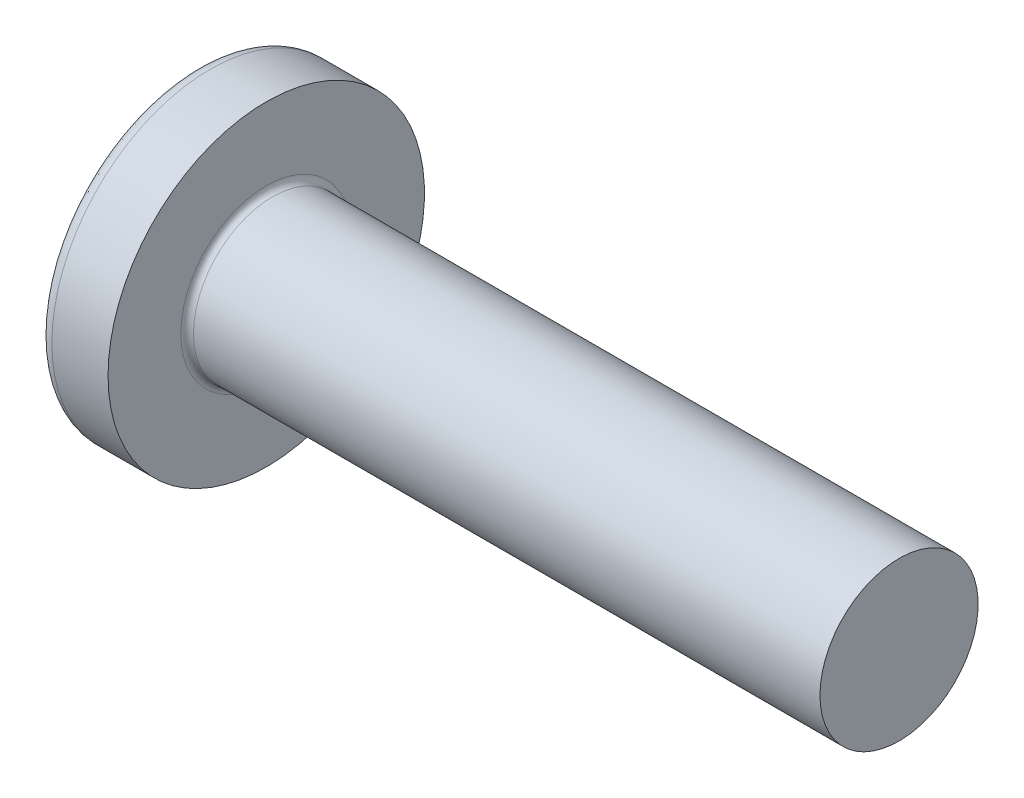
ISO-10303-21;
HEADER;
FILE_DESCRIPTION(('STEP AP214'),'2;1');
FILE_NAME('part.step','',(''),(''),'','','');
FILE_SCHEMA(('AUTOMOTIVE_DESIGN { 1 0 10303 214 1 1 1 1 }'));
ENDSEC;
DATA;
#1=APPLICATION_CONTEXT('core data for automotive mechanical design processes');
#2=APPLICATION_PROTOCOL_DEFINITION('international standard','automotive_design',2000,#1);
#3=PRODUCT_CONTEXT('',#1,'mechanical');
#4=PRODUCT('Part','Part','',(#3));
#5=PRODUCT_RELATED_PRODUCT_CATEGORY('part','',(#4));
#6=PRODUCT_DEFINITION_FORMATION('','',#4);
#7=PRODUCT_DEFINITION_CONTEXT('part definition',#1,'design');
#8=PRODUCT_DEFINITION('design','',#6,#7);
#9=PRODUCT_DEFINITION_SHAPE('','',#8);
#10=(LENGTH_UNIT() NAMED_UNIT(*) SI_UNIT(.MILLI.,.METRE.));
#11=(NAMED_UNIT(*) PLANE_ANGLE_UNIT() SI_UNIT($,.RADIAN.));
#12=(NAMED_UNIT(*) SI_UNIT($,.STERADIAN.) SOLID_ANGLE_UNIT());
#13=UNCERTAINTY_MEASURE_WITH_UNIT(LENGTH_MEASURE(1.E-05),#10,'distance_accuracy_value','');
#14=(GEOMETRIC_REPRESENTATION_CONTEXT(3) GLOBAL_UNCERTAINTY_ASSIGNED_CONTEXT((#13)) GLOBAL_UNIT_ASSIGNED_CONTEXT((#10,
#11,#12)) REPRESENTATION_CONTEXT('',''));
#15=CARTESIAN_POINT('',(0.,0.,0.));
#16=DIRECTION('',(0.,0.,1.));
#17=DIRECTION('',(1.,0.,0.));
#18=AXIS2_PLACEMENT_3D('',#15,#16,#17);
#19=CARTESIAN_POINT('',(16.,0.,0.));
#20=DIRECTION('',(-1.,0.,0.));
#21=DIRECTION('',(0.,1.,0.));
#22=AXIS2_PLACEMENT_3D('',#19,#20,#21);
#23=SPHERICAL_SURFACE('',#22,16.);
#24=CARTESIAN_POINT('',(3.23189799723057,0.,0.));
#25=DIRECTION('',(-1.,0.,0.));
#26=DIRECTION('',(0.,0.,1.));
#27=AXIS2_PLACEMENT_3D('',#24,#25,#26);
#28=CIRCLE('',#27,9.64238410596027);
#29=CARTESIAN_POINT('',(3.23189799723057,0.,9.64238410596027));
#30=VERTEX_POINT('',#29);
#31=EDGE_CURVE('E212',#30,#30,#28,.T.);
#32=ORIENTED_EDGE('',*,*,#31,.T.);
#33=EDGE_LOOP('',(#32));
#34=FACE_BOUND('',#33,.T.);
#35=CARTESIAN_POINT('',(0.168594787067849,0.,0.));
#36=DIRECTION('',(1.,0.,0.));
#37=DIRECTION('',(0.,0.,-1.));
#38=AXIS2_PLACEMENT_3D('',#35,#36,#37);
#39=CIRCLE('',#38,2.31659426398858);
#40=CARTESIAN_POINT('',(0.168594787067853,-1.07999999999999,-2.04944113941943));
#41=VERTEX_POINT('',#40);
#42=CARTESIAN_POINT('',(0.168594787067848,-2.04944113941942,-1.08));
#43=VERTEX_POINT('',#42);
#44=EDGE_CURVE('E338',#41,#43,#39,.F.);
#45=ORIENTED_EDGE('',*,*,#44,.F.);
#46=CARTESIAN_POINT('',(16.,-1.08,0.));
#47=DIRECTION('',(0.,1.,0.));
#48=DIRECTION('',(0.,0.,1.));
#49=AXIS2_PLACEMENT_3D('',#46,#47,#48);
#50=CIRCLE('',#49,15.9635083863166);
#51=CARTESIAN_POINT('',(0.712098414668225,-1.07999999999998,-4.59496083957308));
#52=VERTEX_POINT('',#51);
#53=EDGE_CURVE('E272',#52,#41,#50,.T.);
#54=ORIENTED_EDGE('',*,*,#53,.F.);
#55=CARTESIAN_POINT('',(14.7911432076015,0.,2.42459171093353));
#56=DIRECTION('',(0.446197800778958,0.,-0.89493436774996));
#57=DIRECTION('',(-0.89493436774996,0.,-0.446197800778958));
#58=AXIS2_PLACEMENT_3D('',#55,#56,#57);
#59=CIRCLE('',#58,15.7689574890271);
#60=CARTESIAN_POINT('',(0.712098414668225,1.08000000000002,-4.59496083957307));
#61=VERTEX_POINT('',#60);
#62=EDGE_CURVE('E246',#52,#61,#59,.T.);
#63=ORIENTED_EDGE('',*,*,#62,.T.);
#64=CARTESIAN_POINT('',(16.,1.08,0.));
#65=DIRECTION('',(0.,-1.,0.));
#66=DIRECTION('',(0.,0.,-1.));
#67=AXIS2_PLACEMENT_3D('',#64,#65,#66);
#68=CIRCLE('',#67,15.9635083863166);
#69=CARTESIAN_POINT('',(0.168594787067854,1.08000000000001,-2.04944113941942));
#70=VERTEX_POINT('',#69);
#71=EDGE_CURVE('E300',#70,#61,#68,.T.);
#72=ORIENTED_EDGE('',*,*,#71,.F.);
#73=CARTESIAN_POINT('',(0.168594787067848,2.04944113941941,-1.08));
#74=VERTEX_POINT('',#73);
#75=EDGE_CURVE('E353',#74,#70,#39,.F.);
#76=ORIENTED_EDGE('',*,*,#75,.F.);
#77=CARTESIAN_POINT('',(16.,0.,-1.08));
#78=DIRECTION('',(0.,0.,1.));
#79=DIRECTION('',(1.,0.,0.));
#80=AXIS2_PLACEMENT_3D('',#77,#78,#79);
#81=CIRCLE('',#80,15.9635083863166);
#82=CARTESIAN_POINT('',(0.712098414668223,4.59496083957308,-1.08));
#83=VERTEX_POINT('',#82);
#84=EDGE_CURVE('E240',#83,#74,#81,.T.);
#85=ORIENTED_EDGE('',*,*,#84,.F.);
#86=CARTESIAN_POINT('',(14.7911432076015,-2.42459171093353,0.));
#87=DIRECTION('',(0.446197800778958,0.89493436774996,0.));
#88=DIRECTION('',(-0.89493436774996,0.446197800778958,0.));
#89=AXIS2_PLACEMENT_3D('',#86,#87,#88);
#90=CIRCLE('',#89,15.7689574890271);
#91=CARTESIAN_POINT('',(0.712098414668223,4.59496083957308,1.08));
#92=VERTEX_POINT('',#91);
#93=EDGE_CURVE('E243',#83,#92,#90,.T.);
#94=ORIENTED_EDGE('',*,*,#93,.T.);
#95=CARTESIAN_POINT('',(16.,0.,1.08));
#96=DIRECTION('',(0.,0.,-1.));
#97=DIRECTION('',(0.,1.,0.));
#98=AXIS2_PLACEMENT_3D('',#95,#96,#97);
#99=CIRCLE('',#98,15.9635083863166);
#100=CARTESIAN_POINT('',(0.168594787067849,2.0494411394194,1.08));
#101=VERTEX_POINT('',#100);
#102=EDGE_CURVE('E236',#101,#92,#99,.T.);
#103=ORIENTED_EDGE('',*,*,#102,.F.);
#104=CARTESIAN_POINT('',(0.168594787067853,1.07999999999999,2.04944113941943));
#105=VERTEX_POINT('',#104);
#106=EDGE_CURVE('E352',#105,#101,#39,.F.);
#107=ORIENTED_EDGE('',*,*,#106,.F.);
#108=CARTESIAN_POINT('',(0.712098414668223,1.07999999999998,4.59496083957308));
#109=VERTEX_POINT('',#108);
#110=EDGE_CURVE('E256',#109,#105,#68,.T.);
#111=ORIENTED_EDGE('',*,*,#110,.F.);
#112=CARTESIAN_POINT('',(14.7911432076015,0.,-2.42459171093353));
#113=DIRECTION('',(0.446197800778958,0.,0.89493436774996));
#114=DIRECTION('',(0.89493436774996,0.,-0.446197800778958));
#115=AXIS2_PLACEMENT_3D('',#112,#113,#114);
#116=CIRCLE('',#115,15.7689574890271);
#117=CARTESIAN_POINT('',(0.712098414668221,-1.08000000000001,4.59496083957308));
#118=VERTEX_POINT('',#117);
#119=EDGE_CURVE('E47',#109,#118,#116,.T.);
#120=ORIENTED_EDGE('',*,*,#119,.T.);
#121=CARTESIAN_POINT('',(0.168594787067854,-1.08000000000001,2.04944113941942));
#122=VERTEX_POINT('',#121);
#123=EDGE_CURVE('E253',#122,#118,#50,.T.);
#124=ORIENTED_EDGE('',*,*,#123,.F.);
#125=CARTESIAN_POINT('',(0.168594787067849,-2.04944113941941,1.08));
#126=VERTEX_POINT('',#125);
#127=EDGE_CURVE('E384',#126,#122,#39,.F.);
#128=ORIENTED_EDGE('',*,*,#127,.F.);
#129=CARTESIAN_POINT('',(0.712098414668223,-4.59496083957308,1.08));
#130=VERTEX_POINT('',#129);
#131=EDGE_CURVE('E237',#130,#126,#99,.T.);
#132=ORIENTED_EDGE('',*,*,#131,.F.);
#133=CARTESIAN_POINT('',(14.7911432076015,2.42459171093353,0.));
#134=DIRECTION('',(0.446197800778958,-0.89493436774996,0.));
#135=DIRECTION('',(0.89493436774996,0.446197800778958,0.));
#136=AXIS2_PLACEMENT_3D('',#133,#134,#135);
#137=CIRCLE('',#136,15.7689574890271);
#138=CARTESIAN_POINT('',(0.712098414668223,-4.59496083957308,-1.08));
#139=VERTEX_POINT('',#138);
#140=EDGE_CURVE('E233',#130,#139,#137,.T.);
#141=ORIENTED_EDGE('',*,*,#140,.T.);
#142=EDGE_CURVE('E62',#43,#139,#81,.T.);
#143=ORIENTED_EDGE('',*,*,#142,.F.);
#144=EDGE_LOOP('',(#45,#54,#63,#72,#76,#85,#94,#103,#107,#111,#120,#124,#128,#132,#141,#143));
#145=FACE_BOUND('',#144,.T.);
#146=ADVANCED_FACE('F34',(#34,#145),#23,.T.);
#147=CARTESIAN_POINT('',(0.,4.94999999999999,-1.08));
#148=DIRECTION('',(0.,0.,1.));
#149=DIRECTION('',(1.,0.,0.));
#150=AXIS2_PLACEMENT_3D('',#147,#148,#149);
#151=PLANE('',#150);
#152=ORIENTED_EDGE('',*,*,#84,.T.);
#153=CARTESIAN_POINT('',(-3.43605311056389,2.33057774319368,-1.08));
#154=CARTESIAN_POINT('',(-2.73005788936149,2.27615518507628,-1.08));
#155=CARTESIAN_POINT('',(-2.02408650858328,2.22141913982355,-1.08));
#156=CARTESIAN_POINT('',(-0.612196178896327,2.11110719124856,-1.08));
#157=CARTESIAN_POINT('',(0.0937227687909002,2.05553127230214,-1.08));
#158=CARTESIAN_POINT('',(1.15253879223642,1.97137932907642,-1.08));
#159=CARTESIAN_POINT('',(1.50546717443926,1.94319732850324,-1.08));
#160=CARTESIAN_POINT('',(2.21129884226403,1.88653195912772,-1.08));
#161=CARTESIAN_POINT('',(2.56420212794819,1.85804859110097,-1.08));
#162=CARTESIAN_POINT('',(3.26997437360885,1.80073759682966,-1.08));
#163=CARTESIAN_POINT('',(3.62284333408858,1.77190997678611,-1.08));
#164=CARTESIAN_POINT('',(4.32855163516413,1.71385567830055,-1.08));
#165=CARTESIAN_POINT('',(4.68139097546501,1.68462899627166,-1.08));
#166=CARTESIAN_POINT('',(5.48196138691584,1.61778484426536,-1.08));
#167=CARTESIAN_POINT('',(5.92968063936628,1.5800255789917,-1.08));
#168=CARTESIAN_POINT('',(6.82503914618352,1.50358396776163,-1.08));
#169=CARTESIAN_POINT('',(7.27267840078263,1.46490162453115,-1.08));
#170=CARTESIAN_POINT('',(8.16783657307055,1.38637288862663,-1.08));
#171=CARTESIAN_POINT('',(8.61535549493061,1.34652654360286,-1.08));
#172=CARTESIAN_POINT('',(9.51026248486919,1.26532289179753,-1.08));
#173=CARTESIAN_POINT('',(9.95765055123335,1.22396556604181,-1.08));
#174=CARTESIAN_POINT('',(10.8523158736642,1.13920912306466,-1.08));
#175=CARTESIAN_POINT('',(11.2995930947875,1.09580963592832,-1.08));
#176=CARTESIAN_POINT('',(12.1938496891445,1.00615798148881,-1.08));
#177=CARTESIAN_POINT('',(12.6408290721386,0.959905912835485,-1.08));
#178=CARTESIAN_POINT('',(13.3109832262361,0.887238538031377,-1.08));
#179=CARTESIAN_POINT('',(13.5343356366705,0.862465479305157,-1.08));
#180=CARTESIAN_POINT('',(13.9808744583761,0.811493247434636,-1.08));
#181=CARTESIAN_POINT('',(14.204060872408,0.785294098569613,-1.08));
#182=CARTESIAN_POINT('',(14.6502320441495,0.73099572543514,-1.08));
#183=CARTESIAN_POINT('',(14.8732167746121,0.702896274763054,-1.08));
#184=CARTESIAN_POINT('',(15.2074339176581,0.658726299947166,-1.08));
#185=CARTESIAN_POINT('',(15.3187994773757,0.643665717094798,-1.08));
#186=CARTESIAN_POINT('',(15.5414149899271,0.612700054932443,-1.08));
#187=CARTESIAN_POINT('',(15.6526649406011,0.596794960123566,-1.08));
#188=CARTESIAN_POINT('',(15.7638416271016,0.580382331183072,-1.08));
#189=B_SPLINE_CURVE_WITH_KNOTS('',3,(#153,#154,#155,#156,#157,#158,#159,#160,#161,#162,#163,
#164,#165,#166,#167,#168,#169,#170,#171,#172,#173,#174,#175,#176,#177,#178,#179,#180,#181,#182,
#183,#184,#185,#186,#187,#188),.UNSPECIFIED.,.F.,.F.,(4,2,2,2,2,2,2,2,2,2,2,2,2,2,2,2,2,4),(0.,
2.12426964290659,4.24857885235091,5.3107341035929,6.37288662197896,7.43502003656715,
8.49716300414631,9.84508827634153,11.1930095684778,12.5408757584157,13.8887588800163,
15.2368871027213,16.5849687296847,17.2591314568035,17.9332827098455,18.6075144234906,
18.9446495011757,19.2817907682658),.UNSPECIFIED.);
#190=CARTESIAN_POINT('',(5.69,1.60013444747621,-1.08));
#191=VERTEX_POINT('',#190);
#192=EDGE_CURVE('E373',#74,#191,#189,.T.);
#193=ORIENTED_EDGE('',*,*,#192,.T.);
#194=DIRECTION('',(0.,1.,0.));
#195=VECTOR('',#194,1.);
#196=CARTESIAN_POINT('',(5.69,-2.11307074806449,-1.08));
#197=LINE('',#196,#195);
#198=CARTESIAN_POINT('',(5.69,2.11307074806449,-1.08));
#199=VERTEX_POINT('',#198);
#200=EDGE_CURVE('E321',#191,#199,#197,.T.);
#201=ORIENTED_EDGE('',*,*,#200,.T.);
#202=DIRECTION('',(0.89493436774996,-0.446197800778958,0.));
#203=VECTOR('',#202,1.);
#204=CARTESIAN_POINT('',(0.,4.95,-1.08));
#205=LINE('',#204,#203);
#206=EDGE_CURVE('E213',#83,#199,#205,.T.);
#207=ORIENTED_EDGE('',*,*,#206,.F.);
#208=EDGE_LOOP('',(#152,#193,#201,#207));
#209=FACE_BOUND('',#208,.T.);
#210=ADVANCED_FACE('F168',(#209),#151,.T.);
#211=CARTESIAN_POINT('',(5.69,-2.11307074806449,-1.08));
#212=VERTEX_POINT('',#211);
#213=CARTESIAN_POINT('',(5.69,-1.60013444747621,-1.08));
#214=VERTEX_POINT('',#213);
#215=EDGE_CURVE('E221',#212,#214,#197,.T.);
#216=ORIENTED_EDGE('',*,*,#215,.T.);
#217=CARTESIAN_POINT('',(-3.43605311056389,-2.33057774319368,-1.08));
#218=CARTESIAN_POINT('',(-2.73005788936149,-2.27615518507629,-1.08));
#219=CARTESIAN_POINT('',(-2.02408650858328,-2.22141913982355,-1.08));
#220=CARTESIAN_POINT('',(-0.612196178896328,-2.11110719124856,-1.08));
#221=CARTESIAN_POINT('',(0.0937227687908998,-2.05553127230214,-1.08));
#222=CARTESIAN_POINT('',(1.15253879223642,-1.97137932907642,-1.08));
#223=CARTESIAN_POINT('',(1.50546717443926,-1.94319732850324,-1.08));
#224=CARTESIAN_POINT('',(2.21129884226403,-1.88653195912772,-1.08));
#225=CARTESIAN_POINT('',(2.56420212794819,-1.85804859110097,-1.08));
#226=CARTESIAN_POINT('',(3.26997437360886,-1.80073759682966,-1.08));
#227=CARTESIAN_POINT('',(3.62284333408858,-1.77190997678611,-1.08));
#228=CARTESIAN_POINT('',(4.32855163516413,-1.71385567830055,-1.08));
#229=CARTESIAN_POINT('',(4.68139097546501,-1.68462899627166,-1.08));
#230=CARTESIAN_POINT('',(5.48196138691584,-1.61778484426536,-1.08));
#231=CARTESIAN_POINT('',(5.92968063936628,-1.5800255789917,-1.08));
#232=CARTESIAN_POINT('',(6.82503914618352,-1.50358396776163,-1.08));
#233=CARTESIAN_POINT('',(7.27267840078263,-1.46490162453115,-1.08));
#234=CARTESIAN_POINT('',(8.16783657307055,-1.38637288862663,-1.08));
#235=CARTESIAN_POINT('',(8.61535549493061,-1.34652654360286,-1.08));
#236=CARTESIAN_POINT('',(9.51026248486919,-1.26532289179753,-1.08));
#237=CARTESIAN_POINT('',(9.95765055123334,-1.22396556604181,-1.08));
#238=CARTESIAN_POINT('',(10.8523158736642,-1.13920912306466,-1.08));
#239=CARTESIAN_POINT('',(11.2995930947875,-1.09580963592832,-1.08));
#240=CARTESIAN_POINT('',(12.1938496891445,-1.00615798148881,-1.08));
#241=CARTESIAN_POINT('',(12.6408290721386,-0.959905912835485,-1.08));
#242=CARTESIAN_POINT('',(13.3109832262361,-0.887238538031376,-1.08));
#243=CARTESIAN_POINT('',(13.5343356366705,-0.862465479305157,-1.08));
#244=CARTESIAN_POINT('',(13.9808744583761,-0.811493247434636,-1.08));
#245=CARTESIAN_POINT('',(14.204060872408,-0.785294098569612,-1.08));
#246=CARTESIAN_POINT('',(14.6502320441495,-0.730995725435139,-1.08));
#247=CARTESIAN_POINT('',(14.8732167746121,-0.702896274763054,-1.08));
#248=CARTESIAN_POINT('',(15.2074339176582,-0.658726299947166,-1.08));
#249=CARTESIAN_POINT('',(15.3187994773757,-0.643665717094798,-1.08));
#250=CARTESIAN_POINT('',(15.5414149899271,-0.612700054932442,-1.08));
#251=CARTESIAN_POINT('',(15.6526649406011,-0.596794960123565,-1.08));
#252=CARTESIAN_POINT('',(15.7638416271017,-0.580382331183071,-1.08));
#253=B_SPLINE_CURVE_WITH_KNOTS('',3,(#217,#218,#219,#220,#221,#222,#223,#224,#225,#226,#227,
#228,#229,#230,#231,#232,#233,#234,#235,#236,#237,#238,#239,#240,#241,#242,#243,#244,#245,#246,
#247,#248,#249,#250,#251,#252),.UNSPECIFIED.,.F.,.F.,(4,2,2,2,2,2,2,2,2,2,2,2,2,2,2,2,2,4),(0.,
2.12426964290659,4.24857885235091,5.3107341035929,6.37288662197896,7.43502003656715,
8.49716300414631,9.84508827634153,11.1930095684778,12.5408757584157,13.8887588800163,
15.2368871027213,16.5849687296847,17.2591314568035,17.9332827098455,18.6075144234906,
18.9446495011757,19.2817907682658),.UNSPECIFIED.);
#254=EDGE_CURVE('E351',#214,#43,#253,.F.);
#255=ORIENTED_EDGE('',*,*,#254,.T.);
#256=ORIENTED_EDGE('',*,*,#142,.T.);
#257=DIRECTION('',(0.89493436774996,0.446197800778958,0.));
#258=VECTOR('',#257,1.);
#259=CARTESIAN_POINT('',(0.,-4.95,-1.08));
#260=LINE('',#259,#258);
#261=EDGE_CURVE('E303',#139,#212,#260,.T.);
#262=ORIENTED_EDGE('',*,*,#261,.T.);
#263=EDGE_LOOP('',(#216,#255,#256,#262));
#264=FACE_BOUND('',#263,.T.);
#265=ADVANCED_FACE('F174',(#264),#151,.T.);
#266=CARTESIAN_POINT('',(0.,-4.94999999999999,1.08));
#267=DIRECTION('',(0.,0.,-1.));
#268=DIRECTION('',(0.,1.,0.));
#269=AXIS2_PLACEMENT_3D('',#266,#267,#268);
#270=PLANE('',#269);
#271=DIRECTION('',(0.,-1.,0.));
#272=VECTOR('',#271,1.);
#273=CARTESIAN_POINT('',(5.69,2.11307074806449,1.08));
#274=LINE('',#273,#272);
#275=CARTESIAN_POINT('',(5.69,2.11307074806449,1.08));
#276=VERTEX_POINT('',#275);
#277=CARTESIAN_POINT('',(5.69,1.60013444747621,1.08));
#278=VERTEX_POINT('',#277);
#279=EDGE_CURVE('E311',#276,#278,#274,.T.);
#280=ORIENTED_EDGE('',*,*,#279,.T.);
#281=CARTESIAN_POINT('',(-3.43605312354531,2.33057774419416,1.08));
#282=CARTESIAN_POINT('',(-2.73005790068362,2.27615518595292,1.08));
#283=CARTESIAN_POINT('',(-2.02408651824618,2.22141914057536,1.08));
#284=CARTESIAN_POINT('',(-0.612196185240834,2.11110719174749,1.08));
#285=CARTESIAN_POINT('',(0.0937227641055548,2.055531272673,1.08));
#286=CARTESIAN_POINT('',(1.15253879056997,1.97137932920962,1.08));
#287=CARTESIAN_POINT('',(1.50546717413264,1.94319732852816,1.08));
#288=CARTESIAN_POINT('',(2.21129884467686,1.88653195893371,1.08));
#289=CARTESIAN_POINT('',(2.56420213172064,1.85804859079632,1.08));
#290=CARTESIAN_POINT('',(3.26997438010022,1.80073759630085,1.08));
#291=CARTESIAN_POINT('',(3.62284334193923,1.77190997614379,1.08));
#292=CARTESIAN_POINT('',(4.32855164573311,1.7138556774276,1.08));
#293=CARTESIAN_POINT('',(4.68139098739302,1.68462899528161,1.08));
#294=CARTESIAN_POINT('',(5.48196140020257,1.61778484314849,1.08));
#295=CARTESIAN_POINT('',(5.92968065265283,1.58002557786661,1.08));
#296=CARTESIAN_POINT('',(6.82503915946948,1.50358396661807,1.08));
#297=CARTESIAN_POINT('',(7.27267841406819,1.46490162337736,1.08));
#298=CARTESIAN_POINT('',(8.16783658635485,1.38637288744954,1.08));
#299=CARTESIAN_POINT('',(8.61535550821404,1.34652654241272,1.08));
#300=CARTESIAN_POINT('',(9.51026249815054,1.26532289057715,1.08));
#301=CARTESIAN_POINT('',(9.95765056451348,1.22396556480425,1.08));
#302=CARTESIAN_POINT('',(10.8523158869419,1.13920912178625,1.08));
#303=CARTESIAN_POINT('',(11.299593108064,1.09580963462624,1.08));
#304=CARTESIAN_POINT('',(12.1938497024173,1.0061579801289,1.08));
#305=CARTESIAN_POINT('',(12.6408290854088,0.959905911441419,1.08));
#306=CARTESIAN_POINT('',(13.3109832395008,0.887238536570858,1.08));
#307=CARTESIAN_POINT('',(13.5343356499334,0.862465477819925,1.08));
#308=CARTESIAN_POINT('',(13.9808744716342,0.811493245892374,1.08));
#309=CARTESIAN_POINT('',(14.2040608856631,0.785294096995034,1.08));
#310=CARTESIAN_POINT('',(14.6502320573974,0.730995723784126,1.08));
#311=CARTESIAN_POINT('',(14.8732167878556,0.702896273067916,1.08));
#312=CARTESIAN_POINT('',(15.2074339308928,0.658726298170583,1.08));
#313=CARTESIAN_POINT('',(15.318799490607,0.643665715288516,1.08));
#314=CARTESIAN_POINT('',(15.5414150031506,0.612700053059413,1.08));
#315=CARTESIAN_POINT('',(15.65266495382,0.596794958213489,1.08));
#316=CARTESIAN_POINT('',(15.7638416403152,0.580382329231146,1.08));
#317=B_SPLINE_CURVE_WITH_KNOTS('',3,(#281,#282,#283,#284,#285,#286,#287,#288,#289,#290,#291,
#292,#293,#294,#295,#296,#297,#298,#299,#300,#301,#302,#303,#304,#305,#306,#307,#308,#309,#310,
#311,#312,#313,#314,#315,#316),.UNSPECIFIED.,.F.,.F.,(4,2,2,2,2,2,2,2,2,2,2,2,2,2,2,2,2,4),(0.,
2.12426964789832,4.24857886233492,5.3107341176693,6.37288664014772,7.43502005882796,
8.49716303049931,9.84508830269604,11.1930095948338,12.5408757847726,13.8887589063742,
15.2368871290825,16.5849687560486,17.25913148317,17.9332827362145,18.607514449863,
18.9446495275502,19.2817907946425),.UNSPECIFIED.);
#318=EDGE_CURVE('E277',#278,#101,#317,.F.);
#319=ORIENTED_EDGE('',*,*,#318,.T.);
#320=ORIENTED_EDGE('',*,*,#102,.T.);
#321=DIRECTION('',(0.89493436774996,-0.446197800778958,0.));
#322=VECTOR('',#321,1.);
#323=CARTESIAN_POINT('',(0.,4.95,1.08));
#324=LINE('',#323,#322);
#325=EDGE_CURVE('E218',#92,#276,#324,.T.);
#326=ORIENTED_EDGE('',*,*,#325,.T.);
#327=EDGE_LOOP('',(#280,#319,#320,#326));
#328=FACE_BOUND('',#327,.T.);
#329=ADVANCED_FACE('F369',(#328),#270,.T.);
#330=ORIENTED_EDGE('',*,*,#131,.T.);
#331=CARTESIAN_POINT('',(-3.43605312354531,-2.33057774419416,1.08));
#332=CARTESIAN_POINT('',(-2.73005790068362,-2.27615518595292,1.08));
#333=CARTESIAN_POINT('',(-2.02408651824618,-2.22141914057536,1.08));
#334=CARTESIAN_POINT('',(-0.612196185240835,-2.11110719174749,1.08));
#335=CARTESIAN_POINT('',(0.0937227641055548,-2.055531272673,1.08));
#336=CARTESIAN_POINT('',(1.15253879056997,-1.97137932920962,1.08));
#337=CARTESIAN_POINT('',(1.50546717413264,-1.94319732852816,1.08));
#338=CARTESIAN_POINT('',(2.21129884467686,-1.88653195893371,1.08));
#339=CARTESIAN_POINT('',(2.56420213172064,-1.85804859079632,1.08));
#340=CARTESIAN_POINT('',(3.26997438010022,-1.80073759630085,1.08));
#341=CARTESIAN_POINT('',(3.62284334193923,-1.77190997614379,1.08));
#342=CARTESIAN_POINT('',(4.32855164573311,-1.7138556774276,1.08));
#343=CARTESIAN_POINT('',(4.68139098739302,-1.68462899528161,1.08));
#344=CARTESIAN_POINT('',(5.48196140020257,-1.61778484314849,1.08));
#345=CARTESIAN_POINT('',(5.92968065265283,-1.58002557786661,1.08));
#346=CARTESIAN_POINT('',(6.82503915946948,-1.50358396661807,1.08));
#347=CARTESIAN_POINT('',(7.27267841406819,-1.46490162337736,1.08));
#348=CARTESIAN_POINT('',(8.16783658635484,-1.38637288744954,1.08));
#349=CARTESIAN_POINT('',(8.61535550821403,-1.34652654241272,1.08));
#350=CARTESIAN_POINT('',(9.51026249815054,-1.26532289057715,1.08));
#351=CARTESIAN_POINT('',(9.95765056451347,-1.22396556480425,1.08));
#352=CARTESIAN_POINT('',(10.8523158869419,-1.13920912178625,1.08));
#353=CARTESIAN_POINT('',(11.299593108064,-1.09580963462624,1.08));
#354=CARTESIAN_POINT('',(12.1938497024173,-1.0061579801289,1.08));
#355=CARTESIAN_POINT('',(12.6408290854088,-0.959905911441419,1.08));
#356=CARTESIAN_POINT('',(13.3109832395008,-0.887238536570859,1.08));
#357=CARTESIAN_POINT('',(13.5343356499334,-0.862465477819926,1.08));
#358=CARTESIAN_POINT('',(13.9808744716342,-0.811493245892375,1.08));
#359=CARTESIAN_POINT('',(14.2040608856631,-0.785294096995035,1.08));
#360=CARTESIAN_POINT('',(14.6502320573974,-0.730995723784127,1.08));
#361=CARTESIAN_POINT('',(14.8732167878556,-0.702896273067917,1.08));
#362=CARTESIAN_POINT('',(15.2074339308928,-0.658726298170585,1.08));
#363=CARTESIAN_POINT('',(15.318799490607,-0.643665715288517,1.08));
#364=CARTESIAN_POINT('',(15.5414150031506,-0.612700053059414,1.08));
#365=CARTESIAN_POINT('',(15.65266495382,-0.59679495821349,1.08));
#366=CARTESIAN_POINT('',(15.7638416403152,-0.580382329231147,1.08));
#367=B_SPLINE_CURVE_WITH_KNOTS('',3,(#331,#332,#333,#334,#335,#336,#337,#338,#339,#340,#341,
#342,#343,#344,#345,#346,#347,#348,#349,#350,#351,#352,#353,#354,#355,#356,#357,#358,#359,#360,
#361,#362,#363,#364,#365,#366),.UNSPECIFIED.,.F.,.F.,(4,2,2,2,2,2,2,2,2,2,2,2,2,2,2,2,2,4),(0.,
2.12426964789832,4.24857886233492,5.3107341176693,6.37288664014772,7.43502005882796,
8.49716303049931,9.84508830269604,11.1930095948338,12.5408757847726,13.8887589063742,
15.2368871290825,16.5849687560486,17.25913148317,17.9332827362145,18.607514449863,
18.9446495275502,19.2817907946425),.UNSPECIFIED.);
#368=CARTESIAN_POINT('',(5.69,-1.60013444747621,1.08));
#369=VERTEX_POINT('',#368);
#370=EDGE_CURVE('E385',#126,#369,#367,.T.);
#371=ORIENTED_EDGE('',*,*,#370,.T.);
#372=CARTESIAN_POINT('',(5.69,-2.11307074806449,1.08));
#373=VERTEX_POINT('',#372);
#374=EDGE_CURVE('E313',#369,#373,#274,.T.);
#375=ORIENTED_EDGE('',*,*,#374,.T.);
#376=DIRECTION('',(0.89493436774996,0.446197800778958,0.));
#377=VECTOR('',#376,1.);
#378=CARTESIAN_POINT('',(0.,-4.95,1.08));
#379=LINE('',#378,#377);
#380=EDGE_CURVE('E305',#130,#373,#379,.T.);
#381=ORIENTED_EDGE('',*,*,#380,.F.);
#382=EDGE_LOOP('',(#330,#371,#375,#381));
#383=FACE_BOUND('',#382,.T.);
#384=ADVANCED_FACE('F412',(#383),#270,.T.);
#385=CARTESIAN_POINT('',(5.69,2.11307074806449,-1.08));
#386=DIRECTION('',(-1.,0.,0.));
#387=DIRECTION('',(0.,0.,1.));
#388=AXIS2_PLACEMENT_3D('',#385,#386,#387);
#389=PLANE('',#388);
#390=ORIENTED_EDGE('',*,*,#374,.F.);
#391=CARTESIAN_POINT('',(5.69,0.,0.));
#392=DIRECTION('',(-1.,0.,0.));
#393=DIRECTION('',(0.,0.,1.));
#394=AXIS2_PLACEMENT_3D('',#391,#392,#393);
#395=CIRCLE('',#394,1.9305);
#396=EDGE_CURVE('E346',#214,#369,#395,.T.);
#397=ORIENTED_EDGE('',*,*,#396,.F.);
#398=ORIENTED_EDGE('',*,*,#215,.F.);
#399=DIRECTION('',(0.,0.,1.));
#400=VECTOR('',#399,1.);
#401=CARTESIAN_POINT('',(5.69,-2.11307074806449,-1.08));
#402=LINE('',#401,#400);
#403=EDGE_CURVE('E308',#212,#373,#402,.T.);
#404=ORIENTED_EDGE('',*,*,#403,.T.);
#405=EDGE_LOOP('',(#390,#397,#398,#404));
#406=FACE_BOUND('',#405,.T.);
#407=ADVANCED_FACE('F410',(#406),#389,.T.);
#408=DIRECTION('',(0.,0.,-1.));
#409=VECTOR('',#408,1.);
#410=CARTESIAN_POINT('',(5.69,-1.08000000000001,2.11307074806449));
#411=LINE('',#410,#409);
#412=CARTESIAN_POINT('',(5.69,-1.07999999999999,-1.60013444747621));
#413=VERTEX_POINT('',#412);
#414=CARTESIAN_POINT('',(5.69,-1.07999999999999,-2.1130707480645));
#415=VERTEX_POINT('',#414);
#416=EDGE_CURVE('E294',#413,#415,#411,.T.);
#417=ORIENTED_EDGE('',*,*,#416,.F.);
#418=CARTESIAN_POINT('',(5.69,1.08000000000001,-1.60013444747621));
#419=VERTEX_POINT('',#418);
#420=EDGE_CURVE('E54',#419,#413,#395,.T.);
#421=ORIENTED_EDGE('',*,*,#420,.F.);
#422=DIRECTION('',(0.,0.,1.));
#423=VECTOR('',#422,1.);
#424=CARTESIAN_POINT('',(5.69,1.08000000000001,-2.11307074806449));
#425=LINE('',#424,#423);
#426=CARTESIAN_POINT('',(5.69,1.08000000000001,-2.11307074806449));
#427=VERTEX_POINT('',#426);
#428=EDGE_CURVE('E297',#427,#419,#425,.T.);
#429=ORIENTED_EDGE('',*,*,#428,.F.);
#430=DIRECTION('',(0.,-1.,0.));
#431=VECTOR('',#430,1.);
#432=CARTESIAN_POINT('',(5.69,1.08000000000001,-2.11307074806449));
#433=LINE('',#432,#431);
#434=EDGE_CURVE('E288',#427,#415,#433,.T.);
#435=ORIENTED_EDGE('',*,*,#434,.T.);
#436=EDGE_LOOP('',(#417,#421,#429,#435));
#437=FACE_BOUND('',#436,.T.);
#438=ADVANCED_FACE('F341',(#437),#389,.T.);
#439=ORIENTED_EDGE('',*,*,#200,.F.);
#440=EDGE_CURVE('E345',#278,#191,#395,.T.);
#441=ORIENTED_EDGE('',*,*,#440,.F.);
#442=ORIENTED_EDGE('',*,*,#279,.F.);
#443=DIRECTION('',(0.,0.,-1.));
#444=VECTOR('',#443,1.);
#445=CARTESIAN_POINT('',(5.69,2.11307074806449,1.08));
#446=LINE('',#445,#444);
#447=EDGE_CURVE('E314',#276,#199,#446,.T.);
#448=ORIENTED_EDGE('',*,*,#447,.T.);
#449=EDGE_LOOP('',(#439,#441,#442,#448));
#450=FACE_BOUND('',#449,.T.);
#451=ADVANCED_FACE('F419',(#450),#389,.T.);
#452=CARTESIAN_POINT('',(5.69,1.07999999999999,1.60013444747621));
#453=VERTEX_POINT('',#452);
#454=CARTESIAN_POINT('',(5.69,1.07999999999999,2.1130707480645));
#455=VERTEX_POINT('',#454);
#456=EDGE_CURVE('E270',#453,#455,#425,.T.);
#457=ORIENTED_EDGE('',*,*,#456,.F.);
#458=CARTESIAN_POINT('',(5.69,-1.08000000000001,1.60013444747621));
#459=VERTEX_POINT('',#458);
#460=EDGE_CURVE('E349',#459,#453,#395,.T.);
#461=ORIENTED_EDGE('',*,*,#460,.F.);
#462=CARTESIAN_POINT('',(5.69,-1.08000000000001,2.11307074806449));
#463=VERTEX_POINT('',#462);
#464=EDGE_CURVE('E291',#463,#459,#411,.T.);
#465=ORIENTED_EDGE('',*,*,#464,.F.);
#466=DIRECTION('',(0.,1.,0.));
#467=VECTOR('',#466,1.);
#468=CARTESIAN_POINT('',(5.69,-1.08000000000001,2.11307074806449));
#469=LINE('',#468,#467);
#470=EDGE_CURVE('E295',#463,#455,#469,.T.);
#471=ORIENTED_EDGE('',*,*,#470,.T.);
#472=EDGE_LOOP('',(#457,#461,#465,#471));
#473=FACE_BOUND('',#472,.T.);
#474=ADVANCED_FACE('F414',(#473),#389,.T.);
#475=CARTESIAN_POINT('',(0.,1.07999999999998,4.95));
#476=DIRECTION('',(0.,-1.,0.));
#477=DIRECTION('',(1.,0.,0.));
#478=AXIS2_PLACEMENT_3D('',#475,#476,#477);
#479=PLANE('',#478);
#480=ORIENTED_EDGE('',*,*,#110,.T.);
#481=CARTESIAN_POINT('',(-3.43605312354531,1.07999999999999,2.33057774419416));
#482=CARTESIAN_POINT('',(-2.73005790068362,1.07999999999999,2.27615518595292));
#483=CARTESIAN_POINT('',(-2.02408651824618,1.07999999999999,2.22141914057537));
#484=CARTESIAN_POINT('',(-0.612196185240833,1.07999999999999,2.11110719174749));
#485=CARTESIAN_POINT('',(0.0937227641055566,1.07999999999999,2.055531272673));
#486=CARTESIAN_POINT('',(1.15253879056997,1.07999999999999,1.97137932920963));
#487=CARTESIAN_POINT('',(1.50546717413264,1.07999999999999,1.94319732852816));
#488=CARTESIAN_POINT('',(2.21129884467686,1.07999999999999,1.88653195893372));
#489=CARTESIAN_POINT('',(2.56420213172064,1.07999999999999,1.85804859079632));
#490=CARTESIAN_POINT('',(3.26997438010022,1.07999999999999,1.80073759630085));
#491=CARTESIAN_POINT('',(3.62284334193923,1.07999999999999,1.77190997614379));
#492=CARTESIAN_POINT('',(4.32855164573311,1.07999999999999,1.7138556774276));
#493=CARTESIAN_POINT('',(4.68139098739302,1.07999999999999,1.68462899528162));
#494=CARTESIAN_POINT('',(5.48196140020257,1.07999999999999,1.61778484314849));
#495=CARTESIAN_POINT('',(5.92968065265283,1.07999999999999,1.58002557786661));
#496=CARTESIAN_POINT('',(6.82503915946948,1.07999999999999,1.50358396661808));
#497=CARTESIAN_POINT('',(7.27267841406819,1.07999999999999,1.46490162337736));
#498=CARTESIAN_POINT('',(8.16783658635485,1.08,1.38637288744955));
#499=CARTESIAN_POINT('',(8.61535550821404,1.08,1.34652654241272));
#500=CARTESIAN_POINT('',(9.51026249815054,1.08,1.26532289057715));
#501=CARTESIAN_POINT('',(9.95765056451347,1.08,1.22396556480425));
#502=CARTESIAN_POINT('',(10.8523158869419,1.08,1.13920912178626));
#503=CARTESIAN_POINT('',(11.299593108064,1.08,1.09580963462625));
#504=CARTESIAN_POINT('',(12.1938497024173,1.08,1.0061579801289));
#505=CARTESIAN_POINT('',(12.6408290854088,1.08,0.959905911441422));
#506=CARTESIAN_POINT('',(13.3109832395008,1.08,0.887238536570862));
#507=CARTESIAN_POINT('',(13.5343356499334,1.08,0.862465477819929));
#508=CARTESIAN_POINT('',(13.9808744716342,1.08,0.811493245892377));
#509=CARTESIAN_POINT('',(14.2040608856631,1.08,0.785294096995038));
#510=CARTESIAN_POINT('',(14.6502320573974,1.08,0.730995723784129));
#511=CARTESIAN_POINT('',(14.8732167878556,1.08,0.70289627306792));
#512=CARTESIAN_POINT('',(15.2074339308928,1.08,0.658726298170587));
#513=CARTESIAN_POINT('',(15.318799490607,1.08,0.64366571528852));
#514=CARTESIAN_POINT('',(15.5414150031506,1.08,0.612700053059417));
#515=CARTESIAN_POINT('',(15.65266495382,1.08,0.596794958213493));
#516=CARTESIAN_POINT('',(15.7638416403152,1.08,0.58038232923115));
#517=B_SPLINE_CURVE_WITH_KNOTS('',3,(#481,#482,#483,#484,#485,#486,#487,#488,#489,#490,#491,
#492,#493,#494,#495,#496,#497,#498,#499,#500,#501,#502,#503,#504,#505,#506,#507,#508,#509,#510,
#511,#512,#513,#514,#515,#516),.UNSPECIFIED.,.F.,.F.,(4,2,2,2,2,2,2,2,2,2,2,2,2,2,2,2,2,4),(0.,
2.12426964789832,4.24857886233493,5.31073411766931,6.37288664014773,7.43502005882796,
8.49716303049931,9.84508830269604,11.1930095948338,12.5408757847726,13.8887589063742,
15.2368871290825,16.5849687560486,17.25913148317,17.9332827362145,18.607514449863,
18.9446495275502,19.2817907946425),.UNSPECIFIED.);
#518=EDGE_CURVE('E433',#105,#453,#517,.T.);
#519=ORIENTED_EDGE('',*,*,#518,.T.);
#520=ORIENTED_EDGE('',*,*,#456,.T.);
#521=DIRECTION('',(0.89493436774996,0.,-0.446197800778958));
#522=VECTOR('',#521,1.);
#523=CARTESIAN_POINT('',(0.,1.07999999999998,4.95));
#524=LINE('',#523,#522);
#525=EDGE_CURVE('E263',#109,#455,#524,.T.);
#526=ORIENTED_EDGE('',*,*,#525,.F.);
#527=EDGE_LOOP('',(#480,#519,#520,#526));
#528=FACE_BOUND('',#527,.T.);
#529=ADVANCED_FACE('F267',(#528),#479,.T.);
#530=CARTESIAN_POINT('',(0.,-1.07999999999998,-4.95));
#531=DIRECTION('',(0.,1.,0.));
#532=DIRECTION('',(0.,0.,1.));
#533=AXIS2_PLACEMENT_3D('',#530,#531,#532);
#534=PLANE('',#533);
#535=ORIENTED_EDGE('',*,*,#464,.T.);
#536=CARTESIAN_POINT('',(-3.43605312354531,-1.08000000000001,2.33057774419416));
#537=CARTESIAN_POINT('',(-2.73005790068362,-1.08000000000001,2.27615518595292));
#538=CARTESIAN_POINT('',(-2.02408651824618,-1.08000000000001,2.22141914057536));
#539=CARTESIAN_POINT('',(-0.612196185240835,-1.08000000000001,2.11110719174748));
#540=CARTESIAN_POINT('',(0.093722764105554,-1.08000000000001,2.055531272673));
#541=CARTESIAN_POINT('',(1.15253879056997,-1.08000000000001,1.97137932920962));
#542=CARTESIAN_POINT('',(1.50546717413264,-1.08000000000001,1.94319732852816));
#543=CARTESIAN_POINT('',(2.21129884467685,-1.08000000000001,1.88653195893371));
#544=CARTESIAN_POINT('',(2.56420213172064,-1.08000000000001,1.85804859079632));
#545=CARTESIAN_POINT('',(3.26997438010022,-1.08000000000001,1.80073759630085));
#546=CARTESIAN_POINT('',(3.62284334193923,-1.08000000000001,1.77190997614379));
#547=CARTESIAN_POINT('',(4.32855164573311,-1.08000000000001,1.7138556774276));
#548=CARTESIAN_POINT('',(4.68139098739302,-1.08000000000001,1.68462899528161));
#549=CARTESIAN_POINT('',(5.48196140020257,-1.08000000000001,1.61778484314848));
#550=CARTESIAN_POINT('',(5.92968065265283,-1.08000000000001,1.5800255778666));
#551=CARTESIAN_POINT('',(6.82503915946948,-1.08000000000001,1.50358396661807));
#552=CARTESIAN_POINT('',(7.27267841406818,-1.08,1.46490162337735));
#553=CARTESIAN_POINT('',(8.16783658635484,-1.08,1.38637288744954));
#554=CARTESIAN_POINT('',(8.61535550821403,-1.08,1.34652654241272));
#555=CARTESIAN_POINT('',(9.51026249815053,-1.08,1.26532289057715));
#556=CARTESIAN_POINT('',(9.95765056451347,-1.08,1.22396556480424));
#557=CARTESIAN_POINT('',(10.8523158869419,-1.08,1.13920912178625));
#558=CARTESIAN_POINT('',(11.299593108064,-1.08,1.09580963462624));
#559=CARTESIAN_POINT('',(12.1938497024173,-1.08,1.0061579801289));
#560=CARTESIAN_POINT('',(12.6408290854088,-1.08,0.959905911441415));
#561=CARTESIAN_POINT('',(13.3109832395008,-1.08,0.887238536570855));
#562=CARTESIAN_POINT('',(13.5343356499334,-1.08,0.862465477819922));
#563=CARTESIAN_POINT('',(13.9808744716342,-1.08,0.811493245892371));
#564=CARTESIAN_POINT('',(14.2040608856631,-1.08,0.785294096995031));
#565=CARTESIAN_POINT('',(14.6502320573974,-1.08,0.730995723784123));
#566=CARTESIAN_POINT('',(14.8732167878556,-1.08,0.702896273067913));
#567=CARTESIAN_POINT('',(15.2074339308928,-1.08,0.65872629817058));
#568=CARTESIAN_POINT('',(15.318799490607,-1.08,0.643665715288513));
#569=CARTESIAN_POINT('',(15.5414150031506,-1.08,0.612700053059411));
#570=CARTESIAN_POINT('',(15.65266495382,-1.08,0.596794958213486));
#571=CARTESIAN_POINT('',(15.7638416403152,-1.08,0.580382329231143));
#572=B_SPLINE_CURVE_WITH_KNOTS('',3,(#536,#537,#538,#539,#540,#541,#542,#543,#544,#545,#546,
#547,#548,#549,#550,#551,#552,#553,#554,#555,#556,#557,#558,#559,#560,#561,#562,#563,#564,#565,
#566,#567,#568,#569,#570,#571),.UNSPECIFIED.,.F.,.F.,(4,2,2,2,2,2,2,2,2,2,2,2,2,2,2,2,2,4),(0.,
2.12426964789832,4.24857886233492,5.3107341176693,6.37288664014772,7.43502005882796,
8.49716303049931,9.84508830269603,11.1930095948338,12.5408757847726,13.8887589063742,
15.2368871290825,16.5849687560486,17.25913148317,17.9332827362145,18.607514449863,
18.9446495275502,19.2817907946425),.UNSPECIFIED.);
#573=EDGE_CURVE('E378',#459,#122,#572,.F.);
#574=ORIENTED_EDGE('',*,*,#573,.T.);
#575=ORIENTED_EDGE('',*,*,#123,.T.);
#576=DIRECTION('',(0.89493436774996,0.,-0.446197800778958));
#577=VECTOR('',#576,1.);
#578=CARTESIAN_POINT('',(0.,-1.08000000000002,4.95));
#579=LINE('',#578,#577);
#580=EDGE_CURVE('E265',#118,#463,#579,.T.);
#581=ORIENTED_EDGE('',*,*,#580,.T.);
#582=EDGE_LOOP('',(#535,#574,#575,#581));
#583=FACE_BOUND('',#582,.T.);
#584=ADVANCED_FACE('F203',(#583),#534,.T.);
#585=ORIENTED_EDGE('',*,*,#428,.T.);
#586=CARTESIAN_POINT('',(-3.43605311056389,1.08000000000001,-2.33057774319368));
#587=CARTESIAN_POINT('',(-2.73005788936149,1.08000000000001,-2.27615518507628));
#588=CARTESIAN_POINT('',(-2.02408650858328,1.08000000000001,-2.22141913982354));
#589=CARTESIAN_POINT('',(-0.612196178896327,1.08000000000001,-2.11110719124855));
#590=CARTESIAN_POINT('',(0.0937227687909009,1.08000000000001,-2.05553127230214));
#591=CARTESIAN_POINT('',(1.15253879223642,1.08000000000001,-1.97137932907642));
#592=CARTESIAN_POINT('',(1.50546717443927,1.08000000000001,-1.94319732850324));
#593=CARTESIAN_POINT('',(2.21129884226403,1.08000000000001,-1.88653195912772));
#594=CARTESIAN_POINT('',(2.56420212794819,1.08000000000001,-1.85804859110096));
#595=CARTESIAN_POINT('',(3.26997437360886,1.08000000000001,-1.80073759682965));
#596=CARTESIAN_POINT('',(3.62284333408858,1.08000000000001,-1.77190997678611));
#597=CARTESIAN_POINT('',(4.32855163516413,1.08000000000001,-1.71385567830054));
#598=CARTESIAN_POINT('',(4.68139097546501,1.08000000000001,-1.68462899627166));
#599=CARTESIAN_POINT('',(5.48196138691584,1.08000000000001,-1.61778484426536));
#600=CARTESIAN_POINT('',(5.92968063936628,1.08000000000001,-1.5800255789917));
#601=CARTESIAN_POINT('',(6.82503914618352,1.08000000000001,-1.50358396776162));
#602=CARTESIAN_POINT('',(7.27267840078262,1.08000000000001,-1.46490162453115));
#603=CARTESIAN_POINT('',(8.16783657307055,1.08,-1.38637288862663));
#604=CARTESIAN_POINT('',(8.6153554949306,1.08,-1.34652654360286));
#605=CARTESIAN_POINT('',(9.51026248486919,1.08,-1.26532289179753));
#606=CARTESIAN_POINT('',(9.95765055123334,1.08,-1.22396556604181));
#607=CARTESIAN_POINT('',(10.8523158736642,1.08,-1.13920912306466));
#608=CARTESIAN_POINT('',(11.2995930947875,1.08,-1.09580963592832));
#609=CARTESIAN_POINT('',(12.1938496891445,1.08,-1.0061579814888));
#610=CARTESIAN_POINT('',(12.6408290721386,1.08,-0.959905912835482));
#611=CARTESIAN_POINT('',(13.3109832262361,1.08,-0.887238538031373));
#612=CARTESIAN_POINT('',(13.5343356366705,1.08,-0.862465479305154));
#613=CARTESIAN_POINT('',(13.9808744583761,1.08,-0.811493247434633));
#614=CARTESIAN_POINT('',(14.204060872408,1.08,-0.785294098569609));
#615=CARTESIAN_POINT('',(14.6502320441495,1.08,-0.730995725435137));
#616=CARTESIAN_POINT('',(14.8732167746121,1.08,-0.702896274763051));
#617=CARTESIAN_POINT('',(15.2074339176581,1.08,-0.658726299947163));
#618=CARTESIAN_POINT('',(15.3187994773756,1.08,-0.643665717094795));
#619=CARTESIAN_POINT('',(15.5414149899271,1.08,-0.612700054932439));
#620=CARTESIAN_POINT('',(15.6526649406011,1.08,-0.596794960123562));
#621=CARTESIAN_POINT('',(15.7638416271016,1.08,-0.580382331183068));
#622=B_SPLINE_CURVE_WITH_KNOTS('',3,(#586,#587,#588,#589,#590,#591,#592,#593,#594,#595,#596,
#597,#598,#599,#600,#601,#602,#603,#604,#605,#606,#607,#608,#609,#610,#611,#612,#613,#614,#615,
#616,#617,#618,#619,#620,#621),.UNSPECIFIED.,.F.,.F.,(4,2,2,2,2,2,2,2,2,2,2,2,2,2,2,2,2,4),(0.,
2.12426964290659,4.24857885235092,5.3107341035929,6.37288662197896,7.43502003656715,
8.49716300414631,9.84508827634153,11.1930095684778,12.5408757584157,13.8887588800163,
15.2368871027213,16.5849687296847,17.2591314568035,17.9332827098455,18.6075144234906,
18.9446495011757,19.2817907682658),.UNSPECIFIED.);
#623=EDGE_CURVE('E330',#419,#70,#622,.F.);
#624=ORIENTED_EDGE('',*,*,#623,.T.);
#625=ORIENTED_EDGE('',*,*,#71,.T.);
#626=DIRECTION('',(0.89493436774996,0.,0.446197800778958));
#627=VECTOR('',#626,1.);
#628=CARTESIAN_POINT('',(0.,1.08000000000002,-4.95));
#629=LINE('',#628,#627);
#630=EDGE_CURVE('E274',#61,#427,#629,.T.);
#631=ORIENTED_EDGE('',*,*,#630,.T.);
#632=EDGE_LOOP('',(#585,#624,#625,#631));
#633=FACE_BOUND('',#632,.T.);
#634=ADVANCED_FACE('F201',(#633),#479,.T.);
#635=ORIENTED_EDGE('',*,*,#53,.T.);
#636=CARTESIAN_POINT('',(-3.43605311056389,-1.07999999999999,-2.33057774319368));
#637=CARTESIAN_POINT('',(-2.7300578893615,-1.07999999999999,-2.27615518507629));
#638=CARTESIAN_POINT('',(-2.02408650858328,-1.07999999999999,-2.22141913982355));
#639=CARTESIAN_POINT('',(-0.612196178896328,-1.07999999999999,-2.11110719124856));
#640=CARTESIAN_POINT('',(0.0937227687909014,-1.07999999999999,-2.05553127230215));
#641=CARTESIAN_POINT('',(1.15253879223643,-1.07999999999999,-1.97137932907643));
#642=CARTESIAN_POINT('',(1.50546717443927,-1.07999999999999,-1.94319732850325));
#643=CARTESIAN_POINT('',(2.21129884226403,-1.07999999999999,-1.88653195912772));
#644=CARTESIAN_POINT('',(2.56420212794819,-1.07999999999999,-1.85804859110097));
#645=CARTESIAN_POINT('',(3.26997437360886,-1.07999999999999,-1.80073759682966));
#646=CARTESIAN_POINT('',(3.62284333408858,-1.07999999999999,-1.77190997678612));
#647=CARTESIAN_POINT('',(4.32855163516414,-1.07999999999999,-1.71385567830055));
#648=CARTESIAN_POINT('',(4.68139097546501,-1.07999999999999,-1.68462899627167));
#649=CARTESIAN_POINT('',(5.48196138691584,-1.07999999999999,-1.61778484426537));
#650=CARTESIAN_POINT('',(5.92968063936628,-1.07999999999999,-1.58002557899171));
#651=CARTESIAN_POINT('',(6.82503914618352,-1.07999999999999,-1.50358396776163));
#652=CARTESIAN_POINT('',(7.27267840078262,-1.07999999999999,-1.46490162453115));
#653=CARTESIAN_POINT('',(8.16783657307055,-1.07999999999999,-1.38637288862664));
#654=CARTESIAN_POINT('',(8.6153554949306,-1.07999999999999,-1.34652654360287));
#655=CARTESIAN_POINT('',(9.51026248486919,-1.08,-1.26532289179754));
#656=CARTESIAN_POINT('',(9.95765055123334,-1.08,-1.22396556604182));
#657=CARTESIAN_POINT('',(10.8523158736642,-1.08,-1.13920912306467));
#658=CARTESIAN_POINT('',(11.2995930947875,-1.08,-1.09580963592832));
#659=CARTESIAN_POINT('',(12.1938496891445,-1.08,-1.00615798148881));
#660=CARTESIAN_POINT('',(12.6408290721386,-1.08,-0.95990591283549));
#661=CARTESIAN_POINT('',(13.3109832262361,-1.08,-0.887238538031381));
#662=CARTESIAN_POINT('',(13.5343356366705,-1.08,-0.862465479305162));
#663=CARTESIAN_POINT('',(13.9808744583761,-1.08,-0.811493247434641));
#664=CARTESIAN_POINT('',(14.204060872408,-1.08,-0.785294098569617));
#665=CARTESIAN_POINT('',(14.6502320441495,-1.08,-0.730995725435144));
#666=CARTESIAN_POINT('',(14.8732167746121,-1.08,-0.702896274763059));
#667=CARTESIAN_POINT('',(15.2074339176582,-1.08,-0.658726299947171));
#668=CARTESIAN_POINT('',(15.3187994773757,-1.08,-0.643665717094803));
#669=CARTESIAN_POINT('',(15.5414149899271,-1.08,-0.612700054932447));
#670=CARTESIAN_POINT('',(15.6526649406011,-1.08,-0.59679496012357));
#671=CARTESIAN_POINT('',(15.7638416271017,-1.08,-0.580382331183076));
#672=B_SPLINE_CURVE_WITH_KNOTS('',3,(#636,#637,#638,#639,#640,#641,#642,#643,#644,#645,#646,
#647,#648,#649,#650,#651,#652,#653,#654,#655,#656,#657,#658,#659,#660,#661,#662,#663,#664,#665,
#666,#667,#668,#669,#670,#671),.UNSPECIFIED.,.F.,.F.,(4,2,2,2,2,2,2,2,2,2,2,2,2,2,2,2,2,4),(0.,
2.12426964290659,4.24857885235092,5.3107341035929,6.37288662197896,7.43502003656715,
8.49716300414631,9.84508827634153,11.1930095684778,12.5408757584157,13.8887588800163,
15.2368871027213,16.5849687296847,17.2591314568035,17.9332827098455,18.6075144234906,
18.9446495011757,19.2817907682658),.UNSPECIFIED.);
#673=EDGE_CURVE('E11',#41,#413,#672,.T.);
#674=ORIENTED_EDGE('',*,*,#673,.T.);
#675=ORIENTED_EDGE('',*,*,#416,.T.);
#676=DIRECTION('',(0.89493436774996,0.,0.446197800778958));
#677=VECTOR('',#676,1.);
#678=CARTESIAN_POINT('',(0.,-1.07999999999998,-4.95));
#679=LINE('',#678,#677);
#680=EDGE_CURVE('E285',#52,#415,#679,.T.);
#681=ORIENTED_EDGE('',*,*,#680,.F.);
#682=EDGE_LOOP('',(#635,#674,#675,#681));
#683=FACE_BOUND('',#682,.T.);
#684=ADVANCED_FACE('F196',(#683),#534,.T.);
#685=CARTESIAN_POINT('',(-25.4,0.,0.));
#686=DIRECTION('',(-1.,0.,0.));
#687=DIRECTION('',(0.,0.,1.));
#688=AXIS2_PLACEMENT_3D('',#685,#686,#687);
#689=CYLINDRICAL_SURFACE('',#688,5.);
#690=CARTESIAN_POINT('',(7.9,0.,0.));
#691=DIRECTION('',(-1.,0.,0.));
#692=DIRECTION('',(0.,0.,1.));
#693=AXIS2_PLACEMENT_3D('',#690,#691,#692);
#694=CIRCLE('',#693,5.);
#695=CARTESIAN_POINT('',(7.9,0.,5.));
#696=VERTEX_POINT('',#695);
#697=EDGE_CURVE('E207',#696,#696,#694,.F.);
#698=ORIENTED_EDGE('',*,*,#697,.T.);
#699=EDGE_LOOP('',(#698));
#700=FACE_BOUND('',#699,.T.);
#701=CARTESIAN_POINT('',(47.5,0.,0.));
#702=DIRECTION('',(-1.,0.,0.));
#703=DIRECTION('',(0.,0.,1.));
#704=AXIS2_PLACEMENT_3D('',#701,#702,#703);
#705=CIRCLE('',#704,5.);
#706=CARTESIAN_POINT('',(47.5,0.,5.));
#707=VERTEX_POINT('',#706);
#708=EDGE_CURVE('E210',#707,#707,#705,.T.);
#709=ORIENTED_EDGE('',*,*,#708,.T.);
#710=EDGE_LOOP('',(#709));
#711=FACE_BOUND('',#710,.T.);
#712=ADVANCED_FACE('F193',(#700,#711),#689,.T.);
#713=CARTESIAN_POINT('',(7.5,5.,0.));
#714=DIRECTION('',(-1.,0.,0.));
#715=DIRECTION('',(0.,0.,1.));
#716=AXIS2_PLACEMENT_3D('',#713,#714,#715);
#717=PLANE('',#716);
#718=CARTESIAN_POINT('',(7.5,0.,0.));
#719=DIRECTION('',(-1.,0.,0.));
#720=DIRECTION('',(0.,0.,1.));
#721=AXIS2_PLACEMENT_3D('',#718,#719,#720);
#722=CIRCLE('',#721,5.4);
#723=CARTESIAN_POINT('',(7.5,0.,5.4));
#724=VERTEX_POINT('',#723);
#725=EDGE_CURVE('E229',#724,#724,#722,.T.);
#726=ORIENTED_EDGE('',*,*,#725,.T.);
#727=EDGE_LOOP('',(#726));
#728=FACE_BOUND('',#727,.T.);
#729=CARTESIAN_POINT('',(7.5,0.,0.));
#730=DIRECTION('',(-1.,0.,0.));
#731=DIRECTION('',(0.,0.,1.));
#732=AXIS2_PLACEMENT_3D('',#729,#730,#731);
#733=CIRCLE('',#732,10.);
#734=CARTESIAN_POINT('',(7.5,0.,10.));
#735=VERTEX_POINT('',#734);
#736=EDGE_CURVE('E226',#735,#735,#733,.T.);
#737=ORIENTED_EDGE('',*,*,#736,.F.);
#738=EDGE_LOOP('',(#737));
#739=FACE_BOUND('',#738,.T.);
#740=ADVANCED_FACE('F190',(#728,#739),#717,.F.);
#741=CARTESIAN_POINT('',(-25.4,0.,0.));
#742=DIRECTION('',(-1.,0.,0.));
#743=DIRECTION('',(0.,0.,1.));
#744=AXIS2_PLACEMENT_3D('',#741,#742,#743);
#745=CYLINDRICAL_SURFACE('',#744,10.);
#746=ORIENTED_EDGE('',*,*,#736,.T.);
#747=EDGE_LOOP('',(#746));
#748=FACE_BOUND('',#747,.T.);
#749=CARTESIAN_POINT('',(3.95010373488635,0.,0.));
#750=DIRECTION('',(-1.,0.,0.));
#751=DIRECTION('',(0.,0.,1.));
#752=AXIS2_PLACEMENT_3D('',#749,#750,#751);
#753=CIRCLE('',#752,10.);
#754=CARTESIAN_POINT('',(3.95010373488635,0.,10.));
#755=VERTEX_POINT('',#754);
#756=EDGE_CURVE('E215',#755,#755,#753,.T.);
#757=ORIENTED_EDGE('',*,*,#756,.F.);
#758=EDGE_LOOP('',(#757));
#759=FACE_BOUND('',#758,.T.);
#760=ADVANCED_FACE('F186',(#748,#759),#745,.T.);
#761=CARTESIAN_POINT('',(3.95010373488635,0.,0.));
#762=DIRECTION('',(-1.,0.,0.));
#763=DIRECTION('',(0.,0.,1.));
#764=AXIS2_PLACEMENT_3D('',#761,#762,#763);
#765=TOROIDAL_SURFACE('',#764,9.1,0.900000000000001);
#766=ORIENTED_EDGE('',*,*,#756,.T.);
#767=EDGE_LOOP('',(#766));
#768=FACE_BOUND('',#767,.T.);
#769=ORIENTED_EDGE('',*,*,#31,.F.);
#770=EDGE_LOOP('',(#769));
#771=FACE_BOUND('',#770,.T.);
#772=ADVANCED_FACE('F183',(#768,#771),#765,.T.);
#773=CARTESIAN_POINT('',(47.5,5.,0.));
#774=DIRECTION('',(1.,0.,0.));
#775=DIRECTION('',(0.,0.,-1.));
#776=AXIS2_PLACEMENT_3D('',#773,#774,#775);
#777=PLANE('',#776);
#778=ORIENTED_EDGE('',*,*,#708,.F.);
#779=EDGE_LOOP('',(#778));
#780=FACE_BOUND('',#779,.T.);
#781=ADVANCED_FACE('F181',(#780),#777,.T.);
#782=CARTESIAN_POINT('',(7.9,0.,0.));
#783=DIRECTION('',(-1.,0.,0.));
#784=DIRECTION('',(0.,0.,1.));
#785=AXIS2_PLACEMENT_3D('',#782,#783,#784);
#786=TOROIDAL_SURFACE('',#785,5.4,0.4);
#787=ORIENTED_EDGE('',*,*,#697,.F.);
#788=EDGE_LOOP('',(#787));
#789=FACE_BOUND('',#788,.T.);
#790=ORIENTED_EDGE('',*,*,#725,.F.);
#791=EDGE_LOOP('',(#790));
#792=FACE_BOUND('',#791,.T.);
#793=ADVANCED_FACE('F36',(#789,#792),#786,.F.);
#794=CARTESIAN_POINT('',(0.,4.95,1.08));
#795=DIRECTION('',(0.446197800778958,0.89493436774996,0.));
#796=DIRECTION('',(-0.89493436774996,0.446197800778958,0.));
#797=AXIS2_PLACEMENT_3D('',#794,#795,#796);
#798=PLANE('',#797);
#799=ORIENTED_EDGE('',*,*,#206,.T.);
#800=ORIENTED_EDGE('',*,*,#447,.F.);
#801=ORIENTED_EDGE('',*,*,#325,.F.);
#802=ORIENTED_EDGE('',*,*,#93,.F.);
#803=EDGE_LOOP('',(#799,#800,#801,#802));
#804=FACE_BOUND('',#803,.T.);
#805=ADVANCED_FACE('F367',(#804),#798,.F.);
#806=CARTESIAN_POINT('',(0.,-4.95,-1.08));
#807=DIRECTION('',(0.446197800778958,-0.89493436774996,0.));
#808=DIRECTION('',(0.89493436774996,0.446197800778958,0.));
#809=AXIS2_PLACEMENT_3D('',#806,#807,#808);
#810=PLANE('',#809);
#811=ORIENTED_EDGE('',*,*,#380,.T.);
#812=ORIENTED_EDGE('',*,*,#403,.F.);
#813=ORIENTED_EDGE('',*,*,#261,.F.);
#814=ORIENTED_EDGE('',*,*,#140,.F.);
#815=EDGE_LOOP('',(#811,#812,#813,#814));
#816=FACE_BOUND('',#815,.T.);
#817=ADVANCED_FACE('F401',(#816),#810,.F.);
#818=CARTESIAN_POINT('',(0.,-1.08000000000002,4.95));
#819=DIRECTION('',(0.446197800778958,0.,0.89493436774996));
#820=DIRECTION('',(-0.89493436774996,0.,0.446197800778958));
#821=AXIS2_PLACEMENT_3D('',#818,#819,#820);
#822=PLANE('',#821);
#823=ORIENTED_EDGE('',*,*,#525,.T.);
#824=ORIENTED_EDGE('',*,*,#470,.F.);
#825=ORIENTED_EDGE('',*,*,#580,.F.);
#826=ORIENTED_EDGE('',*,*,#119,.F.);
#827=EDGE_LOOP('',(#823,#824,#825,#826));
#828=FACE_BOUND('',#827,.T.);
#829=ADVANCED_FACE('F261',(#828),#822,.F.);
#830=CARTESIAN_POINT('',(0.,1.08000000000002,-4.95));
#831=DIRECTION('',(0.446197800778958,0.,-0.89493436774996));
#832=DIRECTION('',(0.89493436774996,0.,0.446197800778958));
#833=AXIS2_PLACEMENT_3D('',#830,#831,#832);
#834=PLANE('',#833);
#835=ORIENTED_EDGE('',*,*,#680,.T.);
#836=ORIENTED_EDGE('',*,*,#434,.F.);
#837=ORIENTED_EDGE('',*,*,#630,.F.);
#838=ORIENTED_EDGE('',*,*,#62,.F.);
#839=EDGE_LOOP('',(#835,#836,#837,#838));
#840=FACE_BOUND('',#839,.T.);
#841=ADVANCED_FACE('F333',(#840),#834,.F.);
#842=CARTESIAN_POINT('',(5.69,0.,0.));
#843=DIRECTION('',(-1.,0.,0.));
#844=DIRECTION('',(0.,0.,1.));
#845=AXIS2_PLACEMENT_3D('',#842,#843,#844);
#846=CONICAL_SURFACE('',#845,1.9305,0.0698131700797659);
#847=EDGE_CURVE('E347',#453,#278,#395,.T.);
#848=ORIENTED_EDGE('',*,*,#847,.F.);
#849=ORIENTED_EDGE('',*,*,#518,.F.);
#850=ORIENTED_EDGE('',*,*,#106,.T.);
#851=ORIENTED_EDGE('',*,*,#318,.F.);
#852=EDGE_LOOP('',(#848,#849,#850,#851));
#853=FACE_BOUND('',#852,.T.);
#854=ADVANCED_FACE('F165',(#853),#846,.F.);
#855=ORIENTED_EDGE('',*,*,#127,.T.);
#856=ORIENTED_EDGE('',*,*,#573,.F.);
#857=EDGE_CURVE('E444',#369,#459,#395,.T.);
#858=ORIENTED_EDGE('',*,*,#857,.F.);
#859=ORIENTED_EDGE('',*,*,#370,.F.);
#860=EDGE_LOOP('',(#855,#856,#858,#859));
#861=FACE_BOUND('',#860,.T.);
#862=ADVANCED_FACE('F399',(#861),#846,.F.);
#863=ORIENTED_EDGE('',*,*,#75,.T.);
#864=ORIENTED_EDGE('',*,*,#623,.F.);
#865=EDGE_CURVE('E342',#191,#419,#395,.T.);
#866=ORIENTED_EDGE('',*,*,#865,.F.);
#867=ORIENTED_EDGE('',*,*,#192,.F.);
#868=EDGE_LOOP('',(#863,#864,#866,#867));
#869=FACE_BOUND('',#868,.T.);
#870=ADVANCED_FACE('F163',(#869),#846,.F.);
#871=EDGE_CURVE('E343',#413,#214,#395,.T.);
#872=ORIENTED_EDGE('',*,*,#871,.F.);
#873=ORIENTED_EDGE('',*,*,#673,.F.);
#874=ORIENTED_EDGE('',*,*,#44,.T.);
#875=ORIENTED_EDGE('',*,*,#254,.F.);
#876=EDGE_LOOP('',(#872,#873,#874,#875));
#877=FACE_BOUND('',#876,.T.);
#878=ADVANCED_FACE('F158',(#877),#846,.F.);
#879=CARTESIAN_POINT('',(6.31725747357761,0.,0.));
#880=DIRECTION('',(-1.,0.,0.));
#881=DIRECTION('',(0.,0.,1.));
#882=AXIS2_PLACEMENT_3D('',#879,#880,#881);
#883=CONICAL_SURFACE('',#882,0.,1.25663706143592);
#884=ORIENTED_EDGE('',*,*,#847,.T.);
#885=ORIENTED_EDGE('',*,*,#440,.T.);
#886=ORIENTED_EDGE('',*,*,#865,.T.);
#887=ORIENTED_EDGE('',*,*,#420,.T.);
#888=ORIENTED_EDGE('',*,*,#871,.T.);
#889=ORIENTED_EDGE('',*,*,#396,.T.);
#890=ORIENTED_EDGE('',*,*,#857,.T.);
#891=ORIENTED_EDGE('',*,*,#460,.T.);
#892=EDGE_LOOP('',(#884,#885,#886,#887,#888,#889,#890,#891));
#893=FACE_BOUND('',#892,.T.);
#894=CARTESIAN_POINT('',(6.31725747357761,0.,0.));
#895=VERTEX_POINT('',#894);
#896=VERTEX_LOOP('',#895);
#897=FACE_BOUND('',#896,.T.);
#898=ADVANCED_FACE('F156',(#893,#897),#883,.F.);
#899=CLOSED_SHELL('',(#146,#210,#265,#329,#384,#407,#438,#451,#474,#529,#584,#634,#684,#712,
#740,#760,#772,#781,#793,#805,#817,#829,#841,#854,#862,#870,#878,#898));
#900=MANIFOLD_SOLID_BREP('B2',#899);
#901=ADVANCED_BREP_SHAPE_REPRESENTATION('',(#18,#900),#14);
#902=SHAPE_DEFINITION_REPRESENTATION(#9,#901);
ENDSEC;
END-ISO-10303-21;
